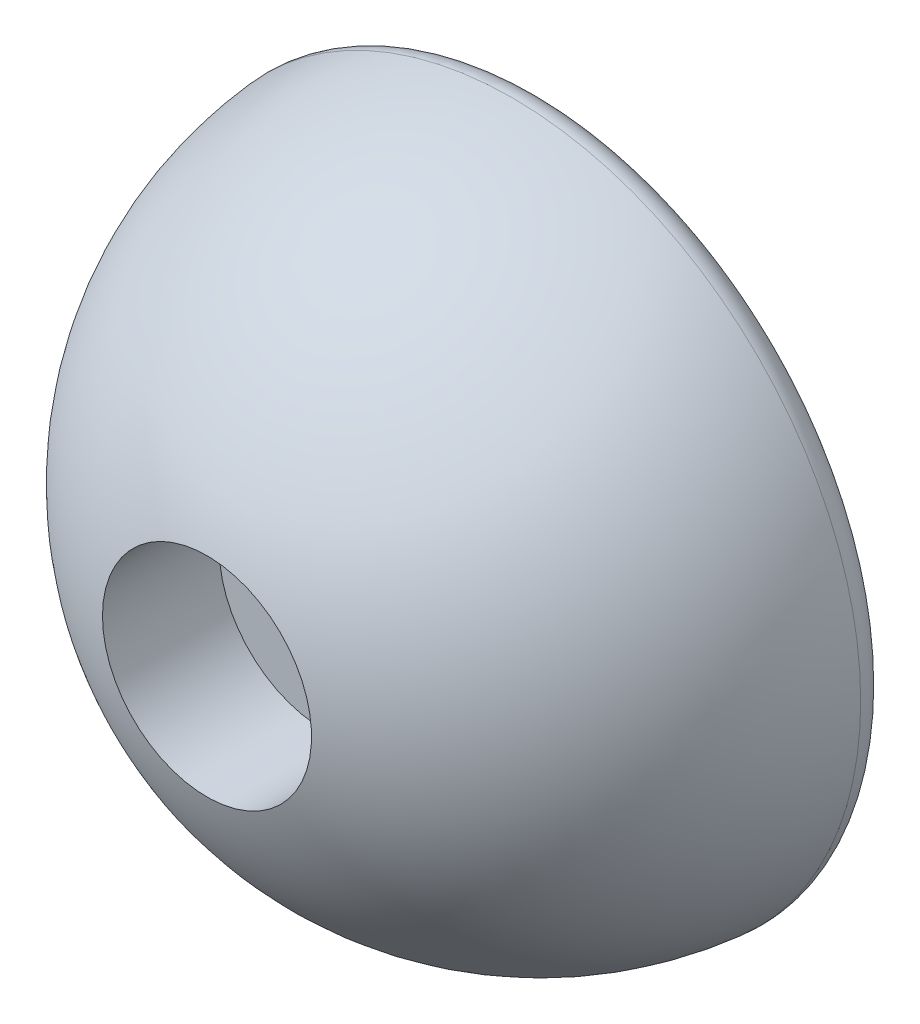
ISO-10303-21;
HEADER;
FILE_DESCRIPTION(('STEP AP214'),'2;1');
FILE_NAME('part.step','',(''),(''),'','','');
FILE_SCHEMA(('AUTOMOTIVE_DESIGN { 1 0 10303 214 1 1 1 1 }'));
ENDSEC;
DATA;
#1=APPLICATION_CONTEXT('core data for automotive mechanical design processes');
#2=APPLICATION_PROTOCOL_DEFINITION('international standard','automotive_design',2000,#1);
#3=PRODUCT_CONTEXT('',#1,'mechanical');
#4=PRODUCT('Part','Part','',(#3));
#5=PRODUCT_RELATED_PRODUCT_CATEGORY('part','',(#4));
#6=PRODUCT_DEFINITION_FORMATION('','',#4);
#7=PRODUCT_DEFINITION_CONTEXT('part definition',#1,'design');
#8=PRODUCT_DEFINITION('design','',#6,#7);
#9=PRODUCT_DEFINITION_SHAPE('','',#8);
#10=(LENGTH_UNIT() NAMED_UNIT(*) SI_UNIT(.MILLI.,.METRE.));
#11=(NAMED_UNIT(*) PLANE_ANGLE_UNIT() SI_UNIT($,.RADIAN.));
#12=(NAMED_UNIT(*) SI_UNIT($,.STERADIAN.) SOLID_ANGLE_UNIT());
#13=UNCERTAINTY_MEASURE_WITH_UNIT(LENGTH_MEASURE(1.E-05),#10,'distance_accuracy_value','');
#14=(GEOMETRIC_REPRESENTATION_CONTEXT(3) GLOBAL_UNCERTAINTY_ASSIGNED_CONTEXT((#13)) GLOBAL_UNIT_ASSIGNED_CONTEXT((#10,
#11,#12)) REPRESENTATION_CONTEXT('',''));
#15=CARTESIAN_POINT('',(0.,0.,0.));
#16=DIRECTION('',(0.,0.,1.));
#17=DIRECTION('',(1.,0.,0.));
#18=AXIS2_PLACEMENT_3D('',#15,#16,#17);
#19=CARTESIAN_POINT('',(0.,0.,0.2));
#20=DIRECTION('',(0.,0.,-1.));
#21=DIRECTION('',(-1.,0.,0.));
#22=AXIS2_PLACEMENT_3D('',#19,#20,#21);
#23=DEGENERATE_TOROIDAL_SURFACE('',#22,0.0999999999999998,2.2,.F.);
#24=CARTESIAN_POINT('',(0.,0.,1.99438978315124));
#25=DIRECTION('',(0.,0.,-1.));
#26=DIRECTION('',(-1.,0.,0.));
#27=AXIS2_PLACEMENT_3D('',#24,#25,#26);
#28=CIRCLE('',#27,1.17285714285714);
#29=CARTESIAN_POINT('',(-1.17285714285714,0.,1.99438978315124));
#30=VERTEX_POINT('',#29);
#31=EDGE_CURVE('E10',#30,#30,#28,.F.);
#32=ORIENTED_EDGE('',*,*,#31,.T.);
#33=EDGE_LOOP('',(#32));
#34=FACE_BOUND('',#33,.T.);
#35=CARTESIAN_POINT('',(0.,0.,0.369230769230769));
#36=DIRECTION('',(0.,0.,-1.));
#37=DIRECTION('',(-1.,0.,0.));
#38=AXIS2_PLACEMENT_3D('',#35,#36,#37);
#39=CIRCLE('',#38,2.09348146715343);
#40=CARTESIAN_POINT('',(-2.09348146715343,0.,0.369230769230769));
#41=VERTEX_POINT('',#40);
#42=EDGE_CURVE('E41',#41,#41,#39,.T.);
#43=ORIENTED_EDGE('',*,*,#42,.T.);
#44=EDGE_LOOP('',(#43));
#45=FACE_BOUND('',#44,.T.);
#46=ADVANCED_FACE('F30',(#34,#45),#23,.T.);
#47=CARTESIAN_POINT('',(0.,0.,0.));
#48=DIRECTION('',(0.,0.,-1.));
#49=DIRECTION('',(-1.,0.,0.));
#50=AXIS2_PLACEMENT_3D('',#47,#48,#49);
#51=CYLINDRICAL_SURFACE('',#50,0.92);
#52=CARTESIAN_POINT('',(0.,0.,2.48376881491976));
#53=DIRECTION('',(0.,0.,1.));
#54=DIRECTION('',(1.,0.,0.));
#55=AXIS2_PLACEMENT_3D('',#52,#53,#54);
#56=CIRCLE('',#55,0.92);
#57=CARTESIAN_POINT('',(0.92,0.,2.48376881491976));
#58=VERTEX_POINT('',#57);
#59=EDGE_CURVE('E37',#58,#58,#56,.F.);
#60=ORIENTED_EDGE('',*,*,#59,.T.);
#61=EDGE_LOOP('',(#60));
#62=FACE_BOUND('',#61,.T.);
#63=CARTESIAN_POINT('',(0.,0.,3.3192562684265));
#64=DIRECTION('',(0.,0.,-1.));
#65=DIRECTION('',(-1.,0.,0.));
#66=AXIS2_PLACEMENT_3D('',#63,#64,#65);
#67=CIRCLE('',#66,0.92);
#68=CARTESIAN_POINT('',(-0.92,0.,3.3192562684265));
#69=VERTEX_POINT('',#68);
#70=EDGE_CURVE('E56',#69,#69,#67,.T.);
#71=ORIENTED_EDGE('',*,*,#70,.F.);
#72=EDGE_LOOP('',(#71));
#73=FACE_BOUND('',#72,.T.);
#74=ADVANCED_FACE('F77',(#62,#73),#51,.F.);
#75=CARTESIAN_POINT('',(1.6,0.,3.3192562684265));
#76=DIRECTION('',(0.,0.,-1.));
#77=DIRECTION('',(-1.,0.,0.));
#78=AXIS2_PLACEMENT_3D('',#75,#76,#77);
#79=PLANE('',#78);
#80=CARTESIAN_POINT('',(0.,0.,3.3192562684265));
#81=DIRECTION('',(0.,0.,-1.));
#82=DIRECTION('',(-1.,0.,0.));
#83=AXIS2_PLACEMENT_3D('',#80,#81,#82);
#84=CIRCLE('',#83,1.6);
#85=CARTESIAN_POINT('',(-1.6,0.,3.3192562684265));
#86=VERTEX_POINT('',#85);
#87=EDGE_CURVE('E59',#86,#86,#84,.T.);
#88=ORIENTED_EDGE('',*,*,#87,.F.);
#89=EDGE_LOOP('',(#88));
#90=FACE_BOUND('',#89,.T.);
#91=ORIENTED_EDGE('',*,*,#70,.T.);
#92=EDGE_LOOP('',(#91));
#93=FACE_BOUND('',#92,.T.);
#94=ADVANCED_FACE('F71',(#90,#93),#79,.F.);
#95=CARTESIAN_POINT('',(0.,0.,0.));
#96=DIRECTION('',(0.,0.,-1.));
#97=DIRECTION('',(-1.,0.,0.));
#98=AXIS2_PLACEMENT_3D('',#95,#96,#97);
#99=CYLINDRICAL_SURFACE('',#98,1.6);
#100=CARTESIAN_POINT('',(0.,0.,5.10514446416553));
#101=DIRECTION('',(0.,0.,-1.));
#102=DIRECTION('',(-1.,0.,0.));
#103=AXIS2_PLACEMENT_3D('',#100,#101,#102);
#104=CIRCLE('',#103,1.6);
#105=CARTESIAN_POINT('',(-1.6,0.,5.10514446416553));
#106=VERTEX_POINT('',#105);
#107=EDGE_CURVE('E62',#106,#106,#104,.T.);
#108=ORIENTED_EDGE('',*,*,#107,.F.);
#109=EDGE_LOOP('',(#108));
#110=FACE_BOUND('',#109,.T.);
#111=ORIENTED_EDGE('',*,*,#87,.T.);
#112=EDGE_LOOP('',(#111));
#113=FACE_BOUND('',#112,.T.);
#114=ADVANCED_FACE('F68',(#110,#113),#99,.F.);
#115=CARTESIAN_POINT('',(0.,0.,0.));
#116=DIRECTION('',(0.,0.,-1.));
#117=DIRECTION('',(1.,0.,0.));
#118=AXIS2_PLACEMENT_3D('',#115,#116,#117);
#119=SPHERICAL_SURFACE('',#118,5.35);
#120=CARTESIAN_POINT('',(0.,0.,0.432323232323232));
#121=DIRECTION('',(0.,0.,-1.));
#122=DIRECTION('',(-1.,0.,0.));
#123=AXIS2_PLACEMENT_3D('',#120,#121,#122);
#124=CIRCLE('',#123,5.33250378553955);
#125=CARTESIAN_POINT('',(-5.33250378553955,0.,0.432323232323232));
#126=VERTEX_POINT('',#125);
#127=EDGE_CURVE('E45',#126,#126,#124,.F.);
#128=ORIENTED_EDGE('',*,*,#127,.T.);
#129=EDGE_LOOP('',(#128));
#130=FACE_BOUND('',#129,.T.);
#131=ORIENTED_EDGE('',*,*,#107,.T.);
#132=EDGE_LOOP('',(#131));
#133=FACE_BOUND('',#132,.T.);
#134=ADVANCED_FACE('F66',(#130,#133),#119,.T.);
#135=CARTESIAN_POINT('',(2.1,0.,0.));
#136=DIRECTION('',(0.,0.,1.));
#137=DIRECTION('',(1.,0.,0.));
#138=AXIS2_PLACEMENT_3D('',#135,#136,#137);
#139=PLANE('',#138);
#140=CARTESIAN_POINT('',(0.,0.,0.));
#141=DIRECTION('',(0.,0.,1.));
#142=DIRECTION('',(1.,0.,0.));
#143=AXIS2_PLACEMENT_3D('',#140,#141,#142);
#144=CIRCLE('',#143,4.93381191372351);
#145=CARTESIAN_POINT('',(4.93381191372351,0.,0.));
#146=VERTEX_POINT('',#145);
#147=EDGE_CURVE('E50',#146,#146,#144,.F.);
#148=ORIENTED_EDGE('',*,*,#147,.T.);
#149=EDGE_LOOP('',(#148));
#150=FACE_BOUND('',#149,.T.);
#151=CARTESIAN_POINT('',(0.,0.,0.));
#152=DIRECTION('',(0.,0.,1.));
#153=DIRECTION('',(1.,0.,0.));
#154=AXIS2_PLACEMENT_3D('',#151,#152,#153);
#155=CIRCLE('',#154,2.49229627936314);
#156=CARTESIAN_POINT('',(2.49229627936314,0.,0.));
#157=VERTEX_POINT('',#156);
#158=EDGE_CURVE('E53',#157,#157,#155,.T.);
#159=ORIENTED_EDGE('',*,*,#158,.T.);
#160=EDGE_LOOP('',(#159));
#161=FACE_BOUND('',#160,.T.);
#162=ADVANCED_FACE('F91',(#150,#161),#139,.F.);
#163=CARTESIAN_POINT('',(0.,0.,0.4));
#164=DIRECTION('',(0.,0.,1.));
#165=DIRECTION('',(1.,0.,0.));
#166=AXIS2_PLACEMENT_3D('',#163,#164,#165);
#167=TOROIDAL_SURFACE('',#166,4.93381191372351,0.4);
#168=ORIENTED_EDGE('',*,*,#127,.F.);
#169=EDGE_LOOP('',(#168));
#170=FACE_BOUND('',#169,.T.);
#171=ORIENTED_EDGE('',*,*,#147,.F.);
#172=EDGE_LOOP('',(#171));
#173=FACE_BOUND('',#172,.T.);
#174=ADVANCED_FACE('F88',(#170,#173),#167,.T.);
#175=CARTESIAN_POINT('',(0.,0.,0.4));
#176=DIRECTION('',(0.,0.,1.));
#177=DIRECTION('',(1.,0.,0.));
#178=AXIS2_PLACEMENT_3D('',#175,#176,#177);
#179=TOROIDAL_SURFACE('',#178,2.49229627936314,0.4);
#180=ORIENTED_EDGE('',*,*,#158,.F.);
#181=EDGE_LOOP('',(#180));
#182=FACE_BOUND('',#181,.T.);
#183=ORIENTED_EDGE('',*,*,#42,.F.);
#184=EDGE_LOOP('',(#183));
#185=FACE_BOUND('',#184,.T.);
#186=ADVANCED_FACE('F90',(#182,#185),#179,.T.);
#187=CARTESIAN_POINT('',(0.,0.,2.48376881491976));
#188=DIRECTION('',(0.,0.,1.));
#189=DIRECTION('',(1.,0.,0.));
#190=AXIS2_PLACEMENT_3D('',#187,#188,#189);
#191=TOROIDAL_SURFACE('',#190,1.52,0.6);
#192=ORIENTED_EDGE('',*,*,#31,.F.);
#193=EDGE_LOOP('',(#192));
#194=FACE_BOUND('',#193,.T.);
#195=ORIENTED_EDGE('',*,*,#59,.F.);
#196=EDGE_LOOP('',(#195));
#197=FACE_BOUND('',#196,.T.);
#198=ADVANCED_FACE('F32',(#194,#197),#191,.T.);
#199=CLOSED_SHELL('',(#46,#74,#94,#114,#134,#162,#174,#186,#198));
#200=MANIFOLD_SOLID_BREP('B2',#199);
#201=ADVANCED_BREP_SHAPE_REPRESENTATION('',(#18,#200),#14);
#202=SHAPE_DEFINITION_REPRESENTATION(#9,#201);
ENDSEC;
END-ISO-10303-21;
